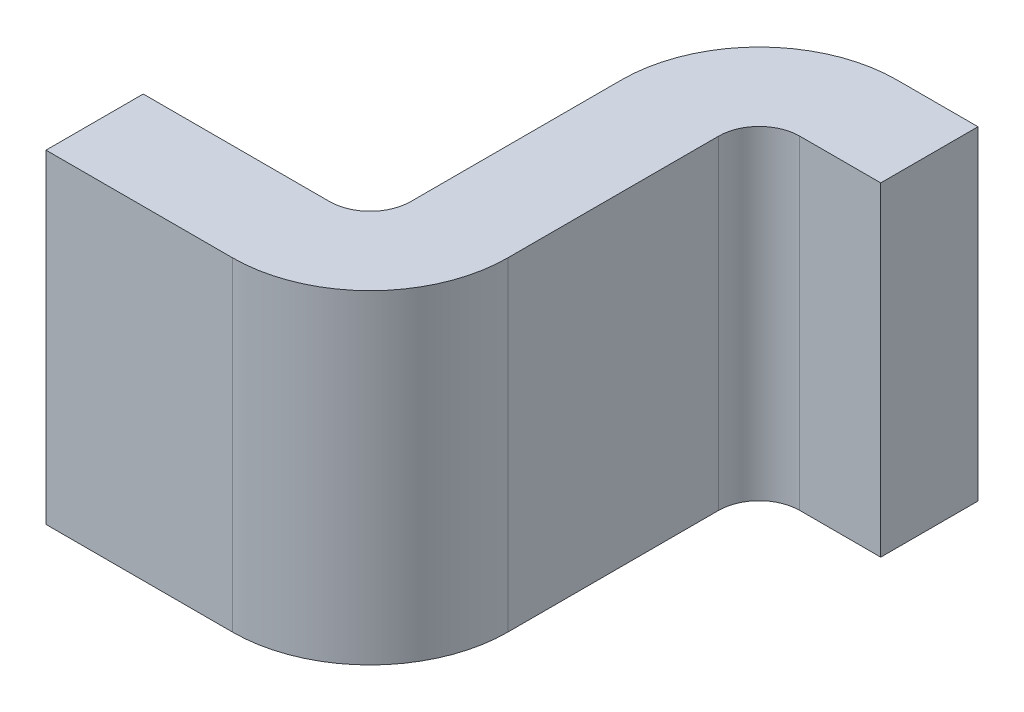
ISO-10303-21;
HEADER;
FILE_DESCRIPTION(('STEP AP214'),'2;1');
FILE_NAME('part.step','',(''),(''),'','','');
FILE_SCHEMA(('AUTOMOTIVE_DESIGN { 1 0 10303 214 1 1 1 1 }'));
ENDSEC;
DATA;
#1=APPLICATION_CONTEXT('core data for automotive mechanical design processes');
#2=APPLICATION_PROTOCOL_DEFINITION('international standard','automotive_design',2000,#1);
#3=PRODUCT_CONTEXT('',#1,'mechanical');
#4=PRODUCT('Part','Part','',(#3));
#5=PRODUCT_RELATED_PRODUCT_CATEGORY('part','',(#4));
#6=PRODUCT_DEFINITION_FORMATION('','',#4);
#7=PRODUCT_DEFINITION_CONTEXT('part definition',#1,'design');
#8=PRODUCT_DEFINITION('design','',#6,#7);
#9=PRODUCT_DEFINITION_SHAPE('','',#8);
#10=(LENGTH_UNIT() NAMED_UNIT(*) SI_UNIT(.MILLI.,.METRE.));
#11=(NAMED_UNIT(*) PLANE_ANGLE_UNIT() SI_UNIT($,.RADIAN.));
#12=(NAMED_UNIT(*) SI_UNIT($,.STERADIAN.) SOLID_ANGLE_UNIT());
#13=UNCERTAINTY_MEASURE_WITH_UNIT(LENGTH_MEASURE(1.E-05),#10,'distance_accuracy_value','');
#14=(GEOMETRIC_REPRESENTATION_CONTEXT(3) GLOBAL_UNCERTAINTY_ASSIGNED_CONTEXT((#13)) GLOBAL_UNIT_ASSIGNED_CONTEXT((#10,
#11,#12)) REPRESENTATION_CONTEXT('',''));
#15=CARTESIAN_POINT('',(0.,0.,0.));
#16=DIRECTION('',(0.,0.,1.));
#17=DIRECTION('',(1.,0.,0.));
#18=AXIS2_PLACEMENT_3D('',#15,#16,#17);
#19=CARTESIAN_POINT('',(3.6,-1.8,-7.43));
#20=DIRECTION('',(0.,-1.,0.));
#21=DIRECTION('',(0.,0.,-1.));
#22=AXIS2_PLACEMENT_3D('',#19,#20,#21);
#23=CYLINDRICAL_SURFACE('',#22,0.0500000000000001);
#24=CARTESIAN_POINT('',(3.6,-2.2,-7.43));
#25=DIRECTION('',(0.,-1.,0.));
#26=DIRECTION('',(0.,0.,-1.));
#27=AXIS2_PLACEMENT_3D('',#24,#25,#26);
#28=CIRCLE('',#27,0.0500000000000001);
#29=CARTESIAN_POINT('',(3.6,-2.2,-7.48));
#30=VERTEX_POINT('',#29);
#31=CARTESIAN_POINT('',(3.55,-2.2,-7.43));
#32=VERTEX_POINT('',#31);
#33=EDGE_CURVE('E198',#30,#32,#28,.F.);
#34=ORIENTED_EDGE('',*,*,#33,.F.);
#35=DIRECTION('',(0.,-1.,0.));
#36=VECTOR('',#35,1.);
#37=CARTESIAN_POINT('',(3.6,-2.,-7.48));
#38=LINE('',#37,#36);
#39=CARTESIAN_POINT('',(3.6,-1.8,-7.48));
#40=VERTEX_POINT('',#39);
#41=EDGE_CURVE('E169',#40,#30,#38,.T.);
#42=ORIENTED_EDGE('',*,*,#41,.F.);
#43=CARTESIAN_POINT('',(3.6,-1.8,-7.43));
#44=DIRECTION('',(0.,-1.,0.));
#45=DIRECTION('',(0.,0.,-1.));
#46=AXIS2_PLACEMENT_3D('',#43,#44,#45);
#47=CIRCLE('',#46,0.0500000000000001);
#48=CARTESIAN_POINT('',(3.55,-1.8,-7.43));
#49=VERTEX_POINT('',#48);
#50=EDGE_CURVE('E179',#49,#40,#47,.T.);
#51=ORIENTED_EDGE('',*,*,#50,.F.);
#52=DIRECTION('',(0.,1.,0.));
#53=VECTOR('',#52,1.);
#54=CARTESIAN_POINT('',(3.55,-2.,-7.43));
#55=LINE('',#54,#53);
#56=EDGE_CURVE('E167',#32,#49,#55,.T.);
#57=ORIENTED_EDGE('',*,*,#56,.F.);
#58=EDGE_LOOP('',(#34,#42,#51,#57));
#59=FACE_BOUND('',#58,.T.);
#60=ADVANCED_FACE('F17',(#59),#23,.F.);
#61=CARTESIAN_POINT('',(3.55,-2.201,-7.169));
#62=DIRECTION('',(1.,0.,0.));
#63=DIRECTION('',(0.,0.,-1.));
#64=AXIS2_PLACEMENT_3D('',#61,#62,#63);
#65=PLANE('',#64);
#66=DIRECTION('',(0.,0.,1.));
#67=VECTOR('',#66,1.);
#68=CARTESIAN_POINT('',(3.55,-2.2,-7.3));
#69=LINE('',#68,#67);
#70=CARTESIAN_POINT('',(3.55,-2.2,-7.17));
#71=VERTEX_POINT('',#70);
#72=EDGE_CURVE('E197',#32,#71,#69,.T.);
#73=ORIENTED_EDGE('',*,*,#72,.F.);
#74=ORIENTED_EDGE('',*,*,#56,.T.);
#75=DIRECTION('',(0.,0.,-1.));
#76=VECTOR('',#75,1.);
#77=CARTESIAN_POINT('',(3.55,-1.8,-7.3));
#78=LINE('',#77,#76);
#79=CARTESIAN_POINT('',(3.55,-1.8,-7.17));
#80=VERTEX_POINT('',#79);
#81=EDGE_CURVE('E202',#80,#49,#78,.T.);
#82=ORIENTED_EDGE('',*,*,#81,.F.);
#83=DIRECTION('',(0.,1.,0.));
#84=VECTOR('',#83,1.);
#85=CARTESIAN_POINT('',(3.55,-2.,-7.17));
#86=LINE('',#85,#84);
#87=EDGE_CURVE('E165',#71,#80,#86,.T.);
#88=ORIENTED_EDGE('',*,*,#87,.F.);
#89=EDGE_LOOP('',(#73,#74,#82,#88));
#90=FACE_BOUND('',#89,.T.);
#91=ADVANCED_FACE('F261',(#90),#65,.T.);
#92=CARTESIAN_POINT('',(3.38,-2.2,-7.17));
#93=DIRECTION('',(0.,1.,0.));
#94=DIRECTION('',(0.,0.,1.));
#95=AXIS2_PLACEMENT_3D('',#92,#93,#94);
#96=CYLINDRICAL_SURFACE('',#95,0.17);
#97=CARTESIAN_POINT('',(3.38,-2.2,-7.17));
#98=DIRECTION('',(0.,1.,0.));
#99=DIRECTION('',(0.,0.,1.));
#100=AXIS2_PLACEMENT_3D('',#97,#98,#99);
#101=CIRCLE('',#100,0.17);
#102=CARTESIAN_POINT('',(3.38,-2.2,-7.));
#103=VERTEX_POINT('',#102);
#104=EDGE_CURVE('E194',#71,#103,#101,.F.);
#105=ORIENTED_EDGE('',*,*,#104,.F.);
#106=ORIENTED_EDGE('',*,*,#87,.T.);
#107=CARTESIAN_POINT('',(3.38,-1.8,-7.17));
#108=DIRECTION('',(0.,1.,0.));
#109=DIRECTION('',(0.,0.,1.));
#110=AXIS2_PLACEMENT_3D('',#107,#108,#109);
#111=CIRCLE('',#110,0.17);
#112=CARTESIAN_POINT('',(3.38,-1.8,-7.));
#113=VERTEX_POINT('',#112);
#114=EDGE_CURVE('E203',#113,#80,#111,.T.);
#115=ORIENTED_EDGE('',*,*,#114,.F.);
#116=DIRECTION('',(0.,1.,0.));
#117=VECTOR('',#116,1.);
#118=CARTESIAN_POINT('',(3.38,-2.,-7.));
#119=LINE('',#118,#117);
#120=EDGE_CURVE('E161',#103,#113,#119,.T.);
#121=ORIENTED_EDGE('',*,*,#120,.F.);
#122=EDGE_LOOP('',(#105,#106,#115,#121));
#123=FACE_BOUND('',#122,.T.);
#124=ADVANCED_FACE('F256',(#123),#96,.T.);
#125=CARTESIAN_POINT('',(3.149,-2.201,-7.));
#126=DIRECTION('',(0.,0.,1.));
#127=DIRECTION('',(1.,0.,0.));
#128=AXIS2_PLACEMENT_3D('',#125,#126,#127);
#129=PLANE('',#128);
#130=DIRECTION('',(-1.,0.,0.));
#131=VECTOR('',#130,1.);
#132=CARTESIAN_POINT('',(3.425,-2.2,-7.));
#133=LINE('',#132,#131);
#134=CARTESIAN_POINT('',(3.15,-2.2,-7.));
#135=VERTEX_POINT('',#134);
#136=EDGE_CURVE('E157',#103,#135,#133,.T.);
#137=ORIENTED_EDGE('',*,*,#136,.F.);
#138=ORIENTED_EDGE('',*,*,#120,.T.);
#139=DIRECTION('',(1.,0.,0.));
#140=VECTOR('',#139,1.);
#141=CARTESIAN_POINT('',(3.425,-1.8,-7.));
#142=LINE('',#141,#140);
#143=CARTESIAN_POINT('',(3.15,-1.8,-7.));
#144=VERTEX_POINT('',#143);
#145=EDGE_CURVE('E185',#144,#113,#142,.T.);
#146=ORIENTED_EDGE('',*,*,#145,.F.);
#147=DIRECTION('',(0.,1.,0.));
#148=VECTOR('',#147,1.);
#149=CARTESIAN_POINT('',(3.15,-2.,-7.));
#150=LINE('',#149,#148);
#151=EDGE_CURVE('E150',#135,#144,#150,.T.);
#152=ORIENTED_EDGE('',*,*,#151,.F.);
#153=EDGE_LOOP('',(#137,#138,#146,#152));
#154=FACE_BOUND('',#153,.T.);
#155=ADVANCED_FACE('F231',(#154),#129,.T.);
#156=CARTESIAN_POINT('',(3.15,-2.201,-7.121));
#157=DIRECTION('',(-1.,0.,0.));
#158=DIRECTION('',(0.,0.,1.));
#159=AXIS2_PLACEMENT_3D('',#156,#157,#158);
#160=PLANE('',#159);
#161=DIRECTION('',(0.,0.,-1.));
#162=VECTOR('',#161,1.);
#163=CARTESIAN_POINT('',(3.15,-2.2,-7.3));
#164=LINE('',#163,#162);
#165=CARTESIAN_POINT('',(3.15,-2.2,-7.12));
#166=VERTEX_POINT('',#165);
#167=EDGE_CURVE('E153',#135,#166,#164,.T.);
#168=ORIENTED_EDGE('',*,*,#167,.F.);
#169=ORIENTED_EDGE('',*,*,#151,.T.);
#170=DIRECTION('',(0.,0.,1.));
#171=VECTOR('',#170,1.);
#172=CARTESIAN_POINT('',(3.15,-1.8,-7.3));
#173=LINE('',#172,#171);
#174=CARTESIAN_POINT('',(3.15,-1.8,-7.12));
#175=VERTEX_POINT('',#174);
#176=EDGE_CURVE('E182',#175,#144,#173,.T.);
#177=ORIENTED_EDGE('',*,*,#176,.F.);
#178=DIRECTION('',(0.,1.,0.));
#179=VECTOR('',#178,1.);
#180=CARTESIAN_POINT('',(3.15,-2.,-7.12));
#181=LINE('',#180,#179);
#182=EDGE_CURVE('E148',#166,#175,#181,.T.);
#183=ORIENTED_EDGE('',*,*,#182,.F.);
#184=EDGE_LOOP('',(#168,#169,#177,#183));
#185=FACE_BOUND('',#184,.T.);
#186=ADVANCED_FACE('F227',(#185),#160,.T.);
#187=CARTESIAN_POINT('',(3.381,-2.201,-7.12));
#188=DIRECTION('',(0.,0.,-1.));
#189=DIRECTION('',(-1.,0.,0.));
#190=AXIS2_PLACEMENT_3D('',#187,#188,#189);
#191=PLANE('',#190);
#192=DIRECTION('',(1.,0.,0.));
#193=VECTOR('',#192,1.);
#194=CARTESIAN_POINT('',(3.425,-2.2,-7.12));
#195=LINE('',#194,#193);
#196=CARTESIAN_POINT('',(3.38,-2.2,-7.12));
#197=VERTEX_POINT('',#196);
#198=EDGE_CURVE('E156',#166,#197,#195,.T.);
#199=ORIENTED_EDGE('',*,*,#198,.F.);
#200=ORIENTED_EDGE('',*,*,#182,.T.);
#201=DIRECTION('',(-1.,0.,0.));
#202=VECTOR('',#201,1.);
#203=CARTESIAN_POINT('',(3.425,-1.8,-7.12));
#204=LINE('',#203,#202);
#205=CARTESIAN_POINT('',(3.38,-1.8,-7.12));
#206=VERTEX_POINT('',#205);
#207=EDGE_CURVE('E186',#206,#175,#204,.T.);
#208=ORIENTED_EDGE('',*,*,#207,.F.);
#209=DIRECTION('',(0.,1.,0.));
#210=VECTOR('',#209,1.);
#211=CARTESIAN_POINT('',(3.38,-2.,-7.12));
#212=LINE('',#211,#210);
#213=EDGE_CURVE('E146',#197,#206,#212,.T.);
#214=ORIENTED_EDGE('',*,*,#213,.F.);
#215=EDGE_LOOP('',(#199,#200,#208,#214));
#216=FACE_BOUND('',#215,.T.);
#217=ADVANCED_FACE('F221',(#216),#191,.T.);
#218=CARTESIAN_POINT('',(3.38,-1.8,-7.17));
#219=DIRECTION('',(0.,-1.,0.));
#220=DIRECTION('',(0.,0.,-1.));
#221=AXIS2_PLACEMENT_3D('',#218,#219,#220);
#222=CYLINDRICAL_SURFACE('',#221,0.0500000000000005);
#223=CARTESIAN_POINT('',(3.38,-2.2,-7.17));
#224=DIRECTION('',(0.,-1.,0.));
#225=DIRECTION('',(0.,0.,-1.));
#226=AXIS2_PLACEMENT_3D('',#223,#224,#225);
#227=CIRCLE('',#226,0.0500000000000005);
#228=CARTESIAN_POINT('',(3.43,-2.2,-7.17));
#229=VERTEX_POINT('',#228);
#230=EDGE_CURVE('E191',#197,#229,#227,.F.);
#231=ORIENTED_EDGE('',*,*,#230,.F.);
#232=ORIENTED_EDGE('',*,*,#213,.T.);
#233=CARTESIAN_POINT('',(3.38,-1.8,-7.17));
#234=DIRECTION('',(0.,-1.,0.));
#235=DIRECTION('',(0.,0.,-1.));
#236=AXIS2_PLACEMENT_3D('',#233,#234,#235);
#237=CIRCLE('',#236,0.0500000000000005);
#238=CARTESIAN_POINT('',(3.43,-1.8,-7.17));
#239=VERTEX_POINT('',#238);
#240=EDGE_CURVE('E205',#239,#206,#237,.T.);
#241=ORIENTED_EDGE('',*,*,#240,.F.);
#242=DIRECTION('',(0.,1.,0.));
#243=VECTOR('',#242,1.);
#244=CARTESIAN_POINT('',(3.43,-2.,-7.17));
#245=LINE('',#244,#243);
#246=EDGE_CURVE('E144',#229,#239,#245,.T.);
#247=ORIENTED_EDGE('',*,*,#246,.F.);
#248=EDGE_LOOP('',(#231,#232,#241,#247));
#249=FACE_BOUND('',#248,.T.);
#250=ADVANCED_FACE('F216',(#249),#222,.F.);
#251=CARTESIAN_POINT('',(3.43,-2.201,-7.431));
#252=DIRECTION('',(-1.,0.,0.));
#253=DIRECTION('',(0.,0.,1.));
#254=AXIS2_PLACEMENT_3D('',#251,#252,#253);
#255=PLANE('',#254);
#256=DIRECTION('',(0.,0.,-1.));
#257=VECTOR('',#256,1.);
#258=CARTESIAN_POINT('',(3.43,-2.2,-7.3));
#259=LINE('',#258,#257);
#260=CARTESIAN_POINT('',(3.43,-2.2,-7.43));
#261=VERTEX_POINT('',#260);
#262=EDGE_CURVE('E190',#229,#261,#259,.T.);
#263=ORIENTED_EDGE('',*,*,#262,.F.);
#264=ORIENTED_EDGE('',*,*,#246,.T.);
#265=DIRECTION('',(0.,0.,1.));
#266=VECTOR('',#265,1.);
#267=CARTESIAN_POINT('',(3.43,-1.8,-7.3));
#268=LINE('',#267,#266);
#269=CARTESIAN_POINT('',(3.43,-1.8,-7.43));
#270=VERTEX_POINT('',#269);
#271=EDGE_CURVE('E114',#270,#239,#268,.T.);
#272=ORIENTED_EDGE('',*,*,#271,.F.);
#273=DIRECTION('',(0.,1.,0.));
#274=VECTOR('',#273,1.);
#275=CARTESIAN_POINT('',(3.43,-2.,-7.43));
#276=LINE('',#275,#274);
#277=EDGE_CURVE('E110',#261,#270,#276,.T.);
#278=ORIENTED_EDGE('',*,*,#277,.F.);
#279=EDGE_LOOP('',(#263,#264,#272,#278));
#280=FACE_BOUND('',#279,.T.);
#281=ADVANCED_FACE('F212',(#280),#255,.T.);
#282=CARTESIAN_POINT('',(3.6,-2.2,-7.43));
#283=DIRECTION('',(0.,1.,0.));
#284=DIRECTION('',(0.,0.,1.));
#285=AXIS2_PLACEMENT_3D('',#282,#283,#284);
#286=CYLINDRICAL_SURFACE('',#285,0.169999999999999);
#287=CARTESIAN_POINT('',(3.6,-2.2,-7.43));
#288=DIRECTION('',(0.,1.,0.));
#289=DIRECTION('',(0.,0.,1.));
#290=AXIS2_PLACEMENT_3D('',#287,#288,#289);
#291=CIRCLE('',#290,0.169999999999999);
#292=CARTESIAN_POINT('',(3.6,-2.2,-7.6));
#293=VERTEX_POINT('',#292);
#294=EDGE_CURVE('E121',#261,#293,#291,.F.);
#295=ORIENTED_EDGE('',*,*,#294,.F.);
#296=ORIENTED_EDGE('',*,*,#277,.T.);
#297=CARTESIAN_POINT('',(3.6,-1.8,-7.43));
#298=DIRECTION('',(0.,1.,0.));
#299=DIRECTION('',(0.,0.,1.));
#300=AXIS2_PLACEMENT_3D('',#297,#298,#299);
#301=CIRCLE('',#300,0.169999999999999);
#302=CARTESIAN_POINT('',(3.6,-1.8,-7.6));
#303=VERTEX_POINT('',#302);
#304=EDGE_CURVE('E21',#303,#270,#301,.T.);
#305=ORIENTED_EDGE('',*,*,#304,.F.);
#306=DIRECTION('',(0.,1.,0.));
#307=VECTOR('',#306,1.);
#308=CARTESIAN_POINT('',(3.6,-2.,-7.6));
#309=LINE('',#308,#307);
#310=EDGE_CURVE('E109',#293,#303,#309,.T.);
#311=ORIENTED_EDGE('',*,*,#310,.F.);
#312=EDGE_LOOP('',(#295,#296,#305,#311));
#313=FACE_BOUND('',#312,.T.);
#314=ADVANCED_FACE('F107',(#313),#286,.T.);
#315=CARTESIAN_POINT('',(3.149,-1.8,-7.601));
#316=DIRECTION('',(0.,1.,0.));
#317=DIRECTION('',(0.,0.,1.));
#318=AXIS2_PLACEMENT_3D('',#315,#316,#317);
#319=PLANE('',#318);
#320=DIRECTION('',(-1.,0.,0.));
#321=VECTOR('',#320,1.);
#322=CARTESIAN_POINT('',(3.65,-1.8,-7.48));
#323=LINE('',#322,#321);
#324=CARTESIAN_POINT('',(3.7,-1.8,-7.48));
#325=VERTEX_POINT('',#324);
#326=EDGE_CURVE('E172',#325,#40,#323,.T.);
#327=ORIENTED_EDGE('',*,*,#326,.F.);
#328=DIRECTION('',(0.,0.,1.));
#329=VECTOR('',#328,1.);
#330=CARTESIAN_POINT('',(3.7,-1.8,-7.54));
#331=LINE('',#330,#329);
#332=CARTESIAN_POINT('',(3.7,-1.8,-7.6));
#333=VERTEX_POINT('',#332);
#334=EDGE_CURVE('E119',#333,#325,#331,.T.);
#335=ORIENTED_EDGE('',*,*,#334,.F.);
#336=DIRECTION('',(1.,0.,0.));
#337=VECTOR('',#336,1.);
#338=CARTESIAN_POINT('',(3.65,-1.8,-7.6));
#339=LINE('',#338,#337);
#340=EDGE_CURVE('E116',#303,#333,#339,.T.);
#341=ORIENTED_EDGE('',*,*,#340,.F.);
#342=ORIENTED_EDGE('',*,*,#304,.T.);
#343=ORIENTED_EDGE('',*,*,#271,.T.);
#344=ORIENTED_EDGE('',*,*,#240,.T.);
#345=ORIENTED_EDGE('',*,*,#207,.T.);
#346=ORIENTED_EDGE('',*,*,#176,.T.);
#347=ORIENTED_EDGE('',*,*,#145,.T.);
#348=ORIENTED_EDGE('',*,*,#114,.T.);
#349=ORIENTED_EDGE('',*,*,#81,.T.);
#350=ORIENTED_EDGE('',*,*,#50,.T.);
#351=EDGE_LOOP('',(#327,#335,#341,#342,#343,#344,#345,#346,#347,#348,#349,#350));
#352=FACE_BOUND('',#351,.T.);
#353=ADVANCED_FACE('F117',(#352),#319,.T.);
#354=CARTESIAN_POINT('',(3.599,-2.201,-7.48));
#355=DIRECTION('',(0.,0.,1.));
#356=DIRECTION('',(1.,0.,0.));
#357=AXIS2_PLACEMENT_3D('',#354,#355,#356);
#358=PLANE('',#357);
#359=DIRECTION('',(-1.,0.,0.));
#360=VECTOR('',#359,1.);
#361=CARTESIAN_POINT('',(3.425,-2.2,-7.48));
#362=LINE('',#361,#360);
#363=CARTESIAN_POINT('',(3.7,-2.2,-7.48));
#364=VERTEX_POINT('',#363);
#365=EDGE_CURVE('E171',#364,#30,#362,.T.);
#366=ORIENTED_EDGE('',*,*,#365,.F.);
#367=DIRECTION('',(0.,-1.,0.));
#368=VECTOR('',#367,1.);
#369=CARTESIAN_POINT('',(3.7,-2.,-7.48));
#370=LINE('',#369,#368);
#371=EDGE_CURVE('E125',#325,#364,#370,.T.);
#372=ORIENTED_EDGE('',*,*,#371,.F.);
#373=ORIENTED_EDGE('',*,*,#326,.T.);
#374=ORIENTED_EDGE('',*,*,#41,.T.);
#375=EDGE_LOOP('',(#366,#372,#373,#374));
#376=FACE_BOUND('',#375,.T.);
#377=ADVANCED_FACE('F266',(#376),#358,.T.);
#378=CARTESIAN_POINT('',(3.149,-2.2,-6.999));
#379=DIRECTION('',(0.,-1.,0.));
#380=DIRECTION('',(0.,0.,-1.));
#381=AXIS2_PLACEMENT_3D('',#378,#379,#380);
#382=PLANE('',#381);
#383=ORIENTED_EDGE('',*,*,#294,.T.);
#384=DIRECTION('',(-1.,0.,0.));
#385=VECTOR('',#384,1.);
#386=CARTESIAN_POINT('',(3.65,-2.2,-7.6));
#387=LINE('',#386,#385);
#388=CARTESIAN_POINT('',(3.7,-2.2,-7.6));
#389=VERTEX_POINT('',#388);
#390=EDGE_CURVE('E36',#389,#293,#387,.T.);
#391=ORIENTED_EDGE('',*,*,#390,.F.);
#392=DIRECTION('',(0.,0.,-1.));
#393=VECTOR('',#392,1.);
#394=CARTESIAN_POINT('',(3.7,-2.2,-7.54));
#395=LINE('',#394,#393);
#396=EDGE_CURVE('E27',#364,#389,#395,.T.);
#397=ORIENTED_EDGE('',*,*,#396,.F.);
#398=ORIENTED_EDGE('',*,*,#365,.T.);
#399=ORIENTED_EDGE('',*,*,#33,.T.);
#400=ORIENTED_EDGE('',*,*,#72,.T.);
#401=ORIENTED_EDGE('',*,*,#104,.T.);
#402=ORIENTED_EDGE('',*,*,#136,.T.);
#403=ORIENTED_EDGE('',*,*,#167,.T.);
#404=ORIENTED_EDGE('',*,*,#198,.T.);
#405=ORIENTED_EDGE('',*,*,#230,.T.);
#406=ORIENTED_EDGE('',*,*,#262,.T.);
#407=EDGE_LOOP('',(#383,#391,#397,#398,#399,#400,#401,#402,#403,#404,#405,#406));
#408=FACE_BOUND('',#407,.T.);
#409=ADVANCED_FACE('F252',(#408),#382,.T.);
#410=CARTESIAN_POINT('',(3.701,-2.201,-7.6));
#411=DIRECTION('',(0.,0.,-1.));
#412=DIRECTION('',(-1.,0.,0.));
#413=AXIS2_PLACEMENT_3D('',#410,#411,#412);
#414=PLANE('',#413);
#415=ORIENTED_EDGE('',*,*,#390,.T.);
#416=ORIENTED_EDGE('',*,*,#310,.T.);
#417=ORIENTED_EDGE('',*,*,#340,.T.);
#418=DIRECTION('',(0.,1.,0.));
#419=VECTOR('',#418,1.);
#420=CARTESIAN_POINT('',(3.7,-2.,-7.6));
#421=LINE('',#420,#419);
#422=EDGE_CURVE('E11',#389,#333,#421,.T.);
#423=ORIENTED_EDGE('',*,*,#422,.F.);
#424=EDGE_LOOP('',(#415,#416,#417,#423));
#425=FACE_BOUND('',#424,.T.);
#426=ADVANCED_FACE('F123',(#425),#414,.T.);
#427=CARTESIAN_POINT('',(3.7,-2.201,-7.479));
#428=DIRECTION('',(1.,0.,0.));
#429=DIRECTION('',(0.,0.,-1.));
#430=AXIS2_PLACEMENT_3D('',#427,#428,#429);
#431=PLANE('',#430);
#432=ORIENTED_EDGE('',*,*,#396,.T.);
#433=ORIENTED_EDGE('',*,*,#422,.T.);
#434=ORIENTED_EDGE('',*,*,#334,.T.);
#435=ORIENTED_EDGE('',*,*,#371,.T.);
#436=EDGE_LOOP('',(#432,#433,#434,#435));
#437=FACE_BOUND('',#436,.T.);
#438=ADVANCED_FACE('F19',(#437),#431,.T.);
#439=CLOSED_SHELL('',(#60,#91,#124,#155,#186,#217,#250,#281,#314,#353,#377,#409,#426,#438));
#440=MANIFOLD_SOLID_BREP('B1',#439);
#441=ADVANCED_BREP_SHAPE_REPRESENTATION('',(#18,#440),#14);
#442=SHAPE_DEFINITION_REPRESENTATION(#9,#441);
ENDSEC;
END-ISO-10303-21;
